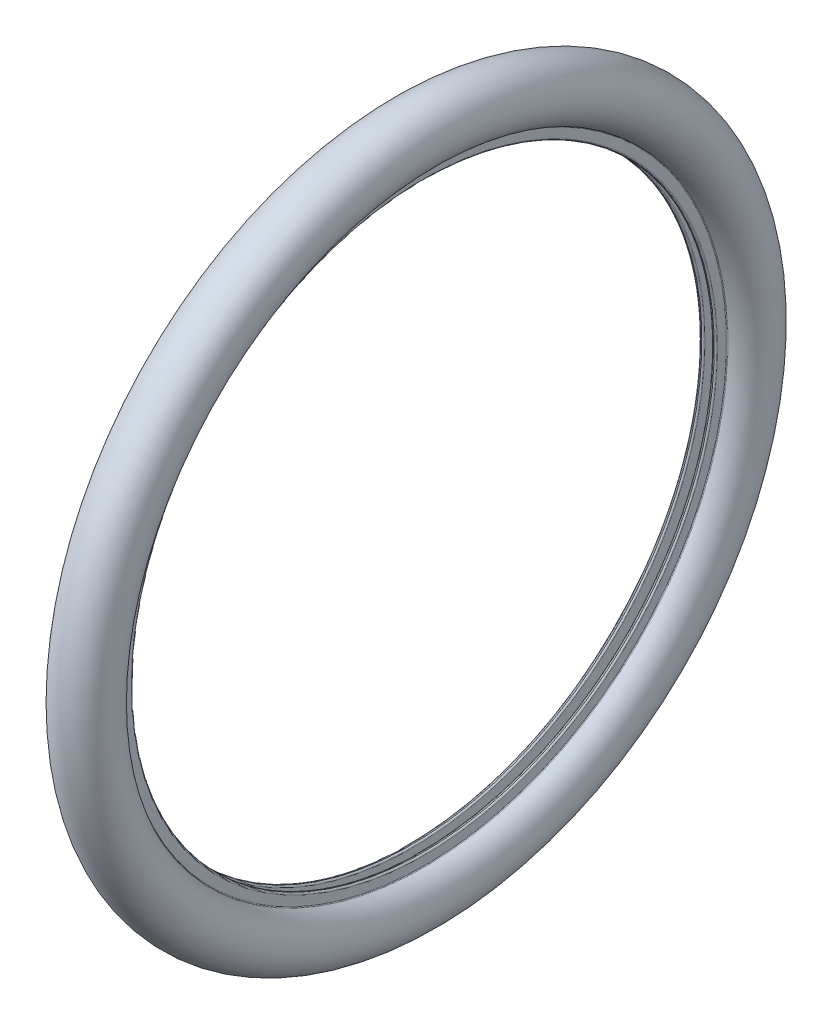
ISO-10303-21;
HEADER;
FILE_DESCRIPTION(('STEP AP214'),'2;1');
FILE_NAME('part.step','',(''),(''),'','','');
FILE_SCHEMA(('AUTOMOTIVE_DESIGN { 1 0 10303 214 1 1 1 1 }'));
ENDSEC;
DATA;
#1=APPLICATION_CONTEXT('core data for automotive mechanical design processes');
#2=APPLICATION_PROTOCOL_DEFINITION('international standard','automotive_design',2000,#1);
#3=PRODUCT_CONTEXT('',#1,'mechanical');
#4=PRODUCT('Part','Part','',(#3));
#5=PRODUCT_RELATED_PRODUCT_CATEGORY('part','',(#4));
#6=PRODUCT_DEFINITION_FORMATION('','',#4);
#7=PRODUCT_DEFINITION_CONTEXT('part definition',#1,'design');
#8=PRODUCT_DEFINITION('design','',#6,#7);
#9=PRODUCT_DEFINITION_SHAPE('','',#8);
#10=(LENGTH_UNIT() NAMED_UNIT(*) SI_UNIT(.MILLI.,.METRE.));
#11=(NAMED_UNIT(*) PLANE_ANGLE_UNIT() SI_UNIT($,.RADIAN.));
#12=(NAMED_UNIT(*) SI_UNIT($,.STERADIAN.) SOLID_ANGLE_UNIT());
#13=UNCERTAINTY_MEASURE_WITH_UNIT(LENGTH_MEASURE(1.E-05),#10,'distance_accuracy_value','');
#14=(GEOMETRIC_REPRESENTATION_CONTEXT(3) GLOBAL_UNCERTAINTY_ASSIGNED_CONTEXT((#13)) GLOBAL_UNIT_ASSIGNED_CONTEXT((#10,
#11,#12)) REPRESENTATION_CONTEXT('',''));
#15=CARTESIAN_POINT('',(0.,0.,0.));
#16=DIRECTION('',(0.,0.,1.));
#17=DIRECTION('',(1.,0.,0.));
#18=AXIS2_PLACEMENT_3D('',#15,#16,#17);
#19=CARTESIAN_POINT('',(0.,0.,0.));
#20=DIRECTION('',(-1.,0.,0.));
#21=DIRECTION('',(0.,0.,1.));
#22=AXIS2_PLACEMENT_3D('',#19,#20,#21);
#23=TOROIDAL_SURFACE('',#22,319.189528299502,19.5);
#24=CARTESIAN_POINT('',(8.,0.,0.));
#25=DIRECTION('',(-1.,0.,0.));
#26=DIRECTION('',(0.,0.,1.));
#27=AXIS2_PLACEMENT_3D('',#24,#25,#26);
#28=CIRCLE('',#27,301.406109055723);
#29=CARTESIAN_POINT('',(8.,0.,301.406109055723));
#30=VERTEX_POINT('',#29);
#31=EDGE_CURVE('E88',#30,#30,#28,.T.);
#32=ORIENTED_EDGE('',*,*,#31,.F.);
#33=EDGE_LOOP('',(#32));
#34=FACE_BOUND('',#33,.T.);
#35=CARTESIAN_POINT('',(-8.,0.,0.));
#36=DIRECTION('',(-1.,0.,0.));
#37=DIRECTION('',(0.,0.,1.));
#38=AXIS2_PLACEMENT_3D('',#35,#36,#37);
#39=CIRCLE('',#38,301.406109055723);
#40=CARTESIAN_POINT('',(-8.,0.,301.406109055723));
#41=VERTEX_POINT('',#40);
#42=EDGE_CURVE('E10',#41,#41,#39,.T.);
#43=ORIENTED_EDGE('',*,*,#42,.T.);
#44=EDGE_LOOP('',(#43));
#45=FACE_BOUND('',#44,.T.);
#46=ADVANCED_FACE('F30',(#34,#45),#23,.F.);
#47=CARTESIAN_POINT('',(-25.,0.,0.));
#48=DIRECTION('',(-1.,0.,0.));
#49=DIRECTION('',(0.,0.,1.));
#50=AXIS2_PLACEMENT_3D('',#47,#48,#49);
#51=CYLINDRICAL_SURFACE('',#50,301.406109055723);
#52=ORIENTED_EDGE('',*,*,#42,.F.);
#53=EDGE_LOOP('',(#52));
#54=FACE_BOUND('',#53,.T.);
#55=CARTESIAN_POINT('',(-7.49999999999998,0.,0.));
#56=DIRECTION('',(-1.,0.,0.));
#57=DIRECTION('',(0.,0.,1.));
#58=AXIS2_PLACEMENT_3D('',#55,#56,#57);
#59=CIRCLE('',#58,301.406109055723);
#60=CARTESIAN_POINT('',(-7.49999999999998,0.,301.406109055723));
#61=VERTEX_POINT('',#60);
#62=EDGE_CURVE('E36',#61,#61,#59,.T.);
#63=ORIENTED_EDGE('',*,*,#62,.T.);
#64=EDGE_LOOP('',(#63));
#65=FACE_BOUND('',#64,.T.);
#66=ADVANCED_FACE('F95',(#54,#65),#51,.T.);
#67=CARTESIAN_POINT('',(-7.49999999999998,0.,0.));
#68=DIRECTION('',(-1.,0.,0.));
#69=DIRECTION('',(0.,0.,1.));
#70=AXIS2_PLACEMENT_3D('',#67,#68,#69);
#71=TOROIDAL_SURFACE('',#70,297.906109055723,3.5);
#72=ORIENTED_EDGE('',*,*,#62,.F.);
#73=EDGE_LOOP('',(#72));
#74=FACE_BOUND('',#73,.T.);
#75=CARTESIAN_POINT('',(-3.99999999999998,0.,0.));
#76=DIRECTION('',(-1.,0.,0.));
#77=DIRECTION('',(0.,0.,1.));
#78=AXIS2_PLACEMENT_3D('',#75,#76,#77);
#79=CIRCLE('',#78,297.906109055723);
#80=CARTESIAN_POINT('',(-3.99999999999998,0.,297.906109055723));
#81=VERTEX_POINT('',#80);
#82=EDGE_CURVE('E40',#81,#81,#79,.T.);
#83=ORIENTED_EDGE('',*,*,#82,.T.);
#84=EDGE_LOOP('',(#83));
#85=FACE_BOUND('',#84,.T.);
#86=ADVANCED_FACE('F99',(#74,#85),#71,.T.);
#87=CARTESIAN_POINT('',(-3.99999999999998,283.5,0.));
#88=DIRECTION('',(-1.,0.,0.));
#89=DIRECTION('',(0.,0.,1.));
#90=AXIS2_PLACEMENT_3D('',#87,#88,#89);
#91=PLANE('',#90);
#92=ORIENTED_EDGE('',*,*,#82,.F.);
#93=EDGE_LOOP('',(#92));
#94=FACE_BOUND('',#93,.T.);
#95=CARTESIAN_POINT('',(-3.99999999999998,0.,0.));
#96=DIRECTION('',(-1.,0.,0.));
#97=DIRECTION('',(0.,0.,1.));
#98=AXIS2_PLACEMENT_3D('',#95,#96,#97);
#99=CIRCLE('',#98,283.5);
#100=CARTESIAN_POINT('',(-3.99999999999998,0.,283.5));
#101=VERTEX_POINT('',#100);
#102=EDGE_CURVE('E44',#101,#101,#99,.T.);
#103=ORIENTED_EDGE('',*,*,#102,.T.);
#104=EDGE_LOOP('',(#103));
#105=FACE_BOUND('',#104,.T.);
#106=ADVANCED_FACE('F104',(#94,#105),#91,.F.);
#107=CARTESIAN_POINT('',(-5.49999999999998,0.,0.));
#108=DIRECTION('',(-1.,0.,0.));
#109=DIRECTION('',(0.,0.,1.));
#110=AXIS2_PLACEMENT_3D('',#107,#108,#109);
#111=TOROIDAL_SURFACE('',#110,283.5,1.5);
#112=ORIENTED_EDGE('',*,*,#102,.F.);
#113=EDGE_LOOP('',(#112));
#114=FACE_BOUND('',#113,.T.);
#115=CARTESIAN_POINT('',(-5.49999999999998,0.,0.));
#116=DIRECTION('',(-1.,0.,0.));
#117=DIRECTION('',(0.,0.,1.));
#118=AXIS2_PLACEMENT_3D('',#115,#116,#117);
#119=CIRCLE('',#118,282.);
#120=CARTESIAN_POINT('',(-5.49999999999998,0.,282.));
#121=VERTEX_POINT('',#120);
#122=EDGE_CURVE('E49',#121,#121,#119,.T.);
#123=ORIENTED_EDGE('',*,*,#122,.T.);
#124=EDGE_LOOP('',(#123));
#125=FACE_BOUND('',#124,.T.);
#126=ADVANCED_FACE('F110',(#114,#125),#111,.T.);
#127=CARTESIAN_POINT('',(-25.,0.,0.));
#128=DIRECTION('',(-1.,0.,0.));
#129=DIRECTION('',(0.,0.,1.));
#130=AXIS2_PLACEMENT_3D('',#127,#128,#129);
#131=CYLINDRICAL_SURFACE('',#130,282.);
#132=ORIENTED_EDGE('',*,*,#122,.F.);
#133=EDGE_LOOP('',(#132));
#134=FACE_BOUND('',#133,.T.);
#135=CARTESIAN_POINT('',(-6.5,0.,0.));
#136=DIRECTION('',(-1.,0.,0.));
#137=DIRECTION('',(0.,0.,1.));
#138=AXIS2_PLACEMENT_3D('',#135,#136,#137);
#139=CIRCLE('',#138,282.);
#140=CARTESIAN_POINT('',(-6.5,0.,282.));
#141=VERTEX_POINT('',#140);
#142=EDGE_CURVE('E52',#141,#141,#139,.T.);
#143=ORIENTED_EDGE('',*,*,#142,.T.);
#144=EDGE_LOOP('',(#143));
#145=FACE_BOUND('',#144,.T.);
#146=ADVANCED_FACE('F114',(#134,#145),#131,.F.);
#147=CARTESIAN_POINT('',(-6.5,0.,0.));
#148=DIRECTION('',(-1.,0.,0.));
#149=DIRECTION('',(0.,0.,1.));
#150=AXIS2_PLACEMENT_3D('',#147,#148,#149);
#151=TOROIDAL_SURFACE('',#150,283.5,1.50000000000003);
#152=ORIENTED_EDGE('',*,*,#142,.F.);
#153=EDGE_LOOP('',(#152));
#154=FACE_BOUND('',#153,.T.);
#155=CARTESIAN_POINT('',(-8.00000000000003,0.,0.));
#156=DIRECTION('',(-1.,0.,0.));
#157=DIRECTION('',(0.,0.,1.));
#158=AXIS2_PLACEMENT_3D('',#155,#156,#157);
#159=CIRCLE('',#158,283.5);
#160=CARTESIAN_POINT('',(-8.00000000000003,0.,283.5));
#161=VERTEX_POINT('',#160);
#162=EDGE_CURVE('E55',#161,#161,#159,.T.);
#163=ORIENTED_EDGE('',*,*,#162,.T.);
#164=EDGE_LOOP('',(#163));
#165=FACE_BOUND('',#164,.T.);
#166=ADVANCED_FACE('F118',(#154,#165),#151,.T.);
#167=CARTESIAN_POINT('',(-8.00000000000001,292.218099487822,0.));
#168=DIRECTION('',(1.,0.,0.));
#169=DIRECTION('',(0.,0.,-1.));
#170=AXIS2_PLACEMENT_3D('',#167,#168,#169);
#171=PLANE('',#170);
#172=ORIENTED_EDGE('',*,*,#162,.F.);
#173=EDGE_LOOP('',(#172));
#174=FACE_BOUND('',#173,.T.);
#175=CARTESIAN_POINT('',(-8.,0.,0.));
#176=DIRECTION('',(-1.,0.,0.));
#177=DIRECTION('',(0.,0.,1.));
#178=AXIS2_PLACEMENT_3D('',#175,#176,#177);
#179=CIRCLE('',#178,292.218099487822);
#180=CARTESIAN_POINT('',(-8.,0.,292.218099487822));
#181=VERTEX_POINT('',#180);
#182=EDGE_CURVE('E58',#181,#181,#179,.T.);
#183=ORIENTED_EDGE('',*,*,#182,.T.);
#184=EDGE_LOOP('',(#183));
#185=FACE_BOUND('',#184,.T.);
#186=ADVANCED_FACE('F122',(#174,#185),#171,.F.);
#187=CARTESIAN_POINT('',(-8.90276851650059,0.,0.));
#188=DIRECTION('',(-1.,0.,0.));
#189=DIRECTION('',(0.,0.,1.));
#190=AXIS2_PLACEMENT_3D('',#187,#188,#189);
#191=TOROIDAL_SURFACE('',#190,292.218099487822,0.902768516500582);
#192=ORIENTED_EDGE('',*,*,#182,.F.);
#193=EDGE_LOOP('',(#192));
#194=FACE_BOUND('',#193,.T.);
#195=CARTESIAN_POINT('',(-8.61979824472162,0.,0.));
#196=DIRECTION('',(-1.,0.,0.));
#197=DIRECTION('',(0.,0.,1.));
#198=AXIS2_PLACEMENT_3D('',#195,#196,#197);
#199=CIRCLE('',#198,293.075373551161);
#200=CARTESIAN_POINT('',(-8.61979824472162,0.,293.075373551161));
#201=VERTEX_POINT('',#200);
#202=EDGE_CURVE('E61',#201,#201,#199,.T.);
#203=ORIENTED_EDGE('',*,*,#202,.T.);
#204=EDGE_LOOP('',(#203));
#205=FACE_BOUND('',#204,.T.);
#206=ADVANCED_FACE('F126',(#194,#205),#191,.F.);
#207=CARTESIAN_POINT('',(0.,0.,0.));
#208=DIRECTION('',(-1.,0.,0.));
#209=DIRECTION('',(0.,0.,1.));
#210=AXIS2_PLACEMENT_3D('',#207,#208,#209);
#211=TOROIDAL_SURFACE('',#210,319.189528299502,27.5);
#212=ORIENTED_EDGE('',*,*,#202,.F.);
#213=EDGE_LOOP('',(#212));
#214=FACE_BOUND('',#213,.T.);
#215=CARTESIAN_POINT('',(8.61979824472161,0.,0.));
#216=DIRECTION('',(-1.,0.,0.));
#217=DIRECTION('',(0.,0.,1.));
#218=AXIS2_PLACEMENT_3D('',#215,#216,#217);
#219=CIRCLE('',#218,293.075373551161);
#220=CARTESIAN_POINT('',(8.61979824472161,0.,293.075373551161));
#221=VERTEX_POINT('',#220);
#222=EDGE_CURVE('E64',#221,#221,#219,.T.);
#223=ORIENTED_EDGE('',*,*,#222,.T.);
#224=EDGE_LOOP('',(#223));
#225=FACE_BOUND('',#224,.T.);
#226=ADVANCED_FACE('F130',(#214,#225),#211,.T.);
#227=CARTESIAN_POINT('',(8.90276851650059,0.,0.));
#228=DIRECTION('',(-1.,0.,0.));
#229=DIRECTION('',(0.,0.,1.));
#230=AXIS2_PLACEMENT_3D('',#227,#228,#229);
#231=TOROIDAL_SURFACE('',#230,292.218099487822,0.902768516500582);
#232=ORIENTED_EDGE('',*,*,#222,.F.);
#233=EDGE_LOOP('',(#232));
#234=FACE_BOUND('',#233,.T.);
#235=CARTESIAN_POINT('',(8.00000000000001,0.,0.));
#236=DIRECTION('',(-1.,0.,0.));
#237=DIRECTION('',(0.,0.,1.));
#238=AXIS2_PLACEMENT_3D('',#235,#236,#237);
#239=CIRCLE('',#238,292.218099487822);
#240=CARTESIAN_POINT('',(8.00000000000001,0.,292.218099487822));
#241=VERTEX_POINT('',#240);
#242=EDGE_CURVE('E67',#241,#241,#239,.T.);
#243=ORIENTED_EDGE('',*,*,#242,.T.);
#244=EDGE_LOOP('',(#243));
#245=FACE_BOUND('',#244,.T.);
#246=ADVANCED_FACE('F134',(#234,#245),#231,.F.);
#247=CARTESIAN_POINT('',(8.,292.218099487822,0.));
#248=DIRECTION('',(-1.,0.,0.));
#249=DIRECTION('',(0.,0.,1.));
#250=AXIS2_PLACEMENT_3D('',#247,#248,#249);
#251=PLANE('',#250);
#252=ORIENTED_EDGE('',*,*,#242,.F.);
#253=EDGE_LOOP('',(#252));
#254=FACE_BOUND('',#253,.T.);
#255=CARTESIAN_POINT('',(8.,0.,0.));
#256=DIRECTION('',(-1.,0.,0.));
#257=DIRECTION('',(0.,0.,1.));
#258=AXIS2_PLACEMENT_3D('',#255,#256,#257);
#259=CIRCLE('',#258,283.5);
#260=CARTESIAN_POINT('',(8.,0.,283.5));
#261=VERTEX_POINT('',#260);
#262=EDGE_CURVE('E70',#261,#261,#259,.T.);
#263=ORIENTED_EDGE('',*,*,#262,.T.);
#264=EDGE_LOOP('',(#263));
#265=FACE_BOUND('',#264,.T.);
#266=ADVANCED_FACE('F138',(#254,#265),#251,.F.);
#267=CARTESIAN_POINT('',(6.5,0.,0.));
#268=DIRECTION('',(-1.,0.,0.));
#269=DIRECTION('',(0.,0.,1.));
#270=AXIS2_PLACEMENT_3D('',#267,#268,#269);
#271=TOROIDAL_SURFACE('',#270,283.5,1.5);
#272=ORIENTED_EDGE('',*,*,#262,.F.);
#273=EDGE_LOOP('',(#272));
#274=FACE_BOUND('',#273,.T.);
#275=CARTESIAN_POINT('',(6.5,0.,0.));
#276=DIRECTION('',(-1.,0.,0.));
#277=DIRECTION('',(0.,0.,1.));
#278=AXIS2_PLACEMENT_3D('',#275,#276,#277);
#279=CIRCLE('',#278,282.);
#280=CARTESIAN_POINT('',(6.5,0.,282.));
#281=VERTEX_POINT('',#280);
#282=EDGE_CURVE('E73',#281,#281,#279,.T.);
#283=ORIENTED_EDGE('',*,*,#282,.T.);
#284=EDGE_LOOP('',(#283));
#285=FACE_BOUND('',#284,.T.);
#286=ADVANCED_FACE('F142',(#274,#285),#271,.T.);
#287=CARTESIAN_POINT('',(-25.,0.,0.));
#288=DIRECTION('',(-1.,0.,0.));
#289=DIRECTION('',(0.,0.,1.));
#290=AXIS2_PLACEMENT_3D('',#287,#288,#289);
#291=CYLINDRICAL_SURFACE('',#290,282.);
#292=ORIENTED_EDGE('',*,*,#282,.F.);
#293=EDGE_LOOP('',(#292));
#294=FACE_BOUND('',#293,.T.);
#295=CARTESIAN_POINT('',(5.49999999999998,0.,0.));
#296=DIRECTION('',(-1.,0.,0.));
#297=DIRECTION('',(0.,0.,1.));
#298=AXIS2_PLACEMENT_3D('',#295,#296,#297);
#299=CIRCLE('',#298,282.);
#300=CARTESIAN_POINT('',(5.49999999999998,0.,282.));
#301=VERTEX_POINT('',#300);
#302=EDGE_CURVE('E76',#301,#301,#299,.T.);
#303=ORIENTED_EDGE('',*,*,#302,.T.);
#304=EDGE_LOOP('',(#303));
#305=FACE_BOUND('',#304,.T.);
#306=ADVANCED_FACE('F146',(#294,#305),#291,.F.);
#307=CARTESIAN_POINT('',(5.49999999999998,0.,0.));
#308=DIRECTION('',(-1.,0.,0.));
#309=DIRECTION('',(0.,0.,1.));
#310=AXIS2_PLACEMENT_3D('',#307,#308,#309);
#311=TOROIDAL_SURFACE('',#310,283.5,1.5);
#312=ORIENTED_EDGE('',*,*,#302,.F.);
#313=EDGE_LOOP('',(#312));
#314=FACE_BOUND('',#313,.T.);
#315=CARTESIAN_POINT('',(3.99999999999998,0.,0.));
#316=DIRECTION('',(-1.,0.,0.));
#317=DIRECTION('',(0.,0.,1.));
#318=AXIS2_PLACEMENT_3D('',#315,#316,#317);
#319=CIRCLE('',#318,283.5);
#320=CARTESIAN_POINT('',(3.99999999999998,0.,283.5));
#321=VERTEX_POINT('',#320);
#322=EDGE_CURVE('E79',#321,#321,#319,.T.);
#323=ORIENTED_EDGE('',*,*,#322,.T.);
#324=EDGE_LOOP('',(#323));
#325=FACE_BOUND('',#324,.T.);
#326=ADVANCED_FACE('F150',(#314,#325),#311,.T.);
#327=CARTESIAN_POINT('',(3.99999999999998,283.5,0.));
#328=DIRECTION('',(1.,0.,0.));
#329=DIRECTION('',(0.,0.,-1.));
#330=AXIS2_PLACEMENT_3D('',#327,#328,#329);
#331=PLANE('',#330);
#332=ORIENTED_EDGE('',*,*,#322,.F.);
#333=EDGE_LOOP('',(#332));
#334=FACE_BOUND('',#333,.T.);
#335=CARTESIAN_POINT('',(3.99999999999998,0.,0.));
#336=DIRECTION('',(-1.,0.,0.));
#337=DIRECTION('',(0.,0.,1.));
#338=AXIS2_PLACEMENT_3D('',#335,#336,#337);
#339=CIRCLE('',#338,297.906109055723);
#340=CARTESIAN_POINT('',(3.99999999999998,0.,297.906109055723));
#341=VERTEX_POINT('',#340);
#342=EDGE_CURVE('E82',#341,#341,#339,.T.);
#343=ORIENTED_EDGE('',*,*,#342,.T.);
#344=EDGE_LOOP('',(#343));
#345=FACE_BOUND('',#344,.T.);
#346=ADVANCED_FACE('F154',(#334,#345),#331,.F.);
#347=CARTESIAN_POINT('',(7.49999999999998,0.,0.));
#348=DIRECTION('',(-1.,0.,0.));
#349=DIRECTION('',(0.,0.,1.));
#350=AXIS2_PLACEMENT_3D('',#347,#348,#349);
#351=TOROIDAL_SURFACE('',#350,297.906109055723,3.5);
#352=ORIENTED_EDGE('',*,*,#342,.F.);
#353=EDGE_LOOP('',(#352));
#354=FACE_BOUND('',#353,.T.);
#355=CARTESIAN_POINT('',(7.49999999999998,0.,0.));
#356=DIRECTION('',(-1.,0.,0.));
#357=DIRECTION('',(0.,0.,1.));
#358=AXIS2_PLACEMENT_3D('',#355,#356,#357);
#359=CIRCLE('',#358,301.406109055723);
#360=CARTESIAN_POINT('',(7.49999999999998,0.,301.406109055723));
#361=VERTEX_POINT('',#360);
#362=EDGE_CURVE('E85',#361,#361,#359,.T.);
#363=ORIENTED_EDGE('',*,*,#362,.T.);
#364=EDGE_LOOP('',(#363));
#365=FACE_BOUND('',#364,.T.);
#366=ADVANCED_FACE('F158',(#354,#365),#351,.T.);
#367=CARTESIAN_POINT('',(-25.,0.,0.));
#368=DIRECTION('',(-1.,0.,0.));
#369=DIRECTION('',(0.,0.,1.));
#370=AXIS2_PLACEMENT_3D('',#367,#368,#369);
#371=CYLINDRICAL_SURFACE('',#370,301.406109055723);
#372=ORIENTED_EDGE('',*,*,#362,.F.);
#373=EDGE_LOOP('',(#372));
#374=FACE_BOUND('',#373,.T.);
#375=ORIENTED_EDGE('',*,*,#31,.T.);
#376=EDGE_LOOP('',(#375));
#377=FACE_BOUND('',#376,.T.);
#378=ADVANCED_FACE('F92',(#374,#377),#371,.T.);
#379=CLOSED_SHELL('',(#46,#66,#86,#106,#126,#146,#166,#186,#206,#226,#246,#266,#286,#306,#326,
#346,#366,#378));
#380=MANIFOLD_SOLID_BREP('B2',#379);
#381=ADVANCED_BREP_SHAPE_REPRESENTATION('',(#18,#380),#14);
#382=SHAPE_DEFINITION_REPRESENTATION(#9,#381);
ENDSEC;
END-ISO-10303-21;
